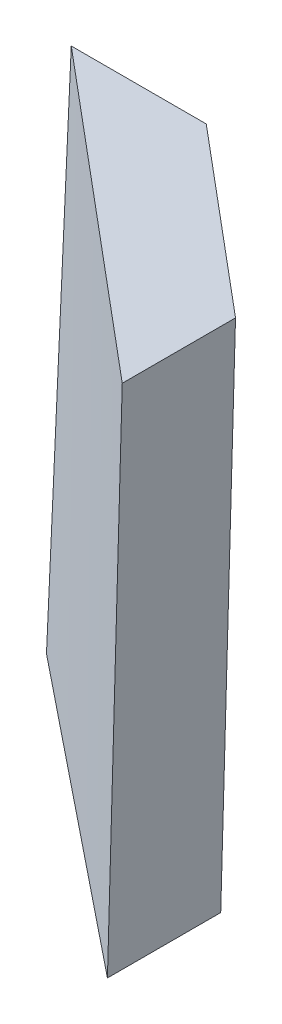
ISO-10303-21;
HEADER;
FILE_DESCRIPTION(('STEP AP214'),'2;1');
FILE_NAME('part.step','',(''),(''),'','','');
FILE_SCHEMA(('AUTOMOTIVE_DESIGN { 1 0 10303 214 1 1 1 1 }'));
ENDSEC;
DATA;
#1=APPLICATION_CONTEXT('core data for automotive mechanical design processes');
#2=APPLICATION_PROTOCOL_DEFINITION('international standard','automotive_design',2000,#1);
#3=PRODUCT_CONTEXT('',#1,'mechanical');
#4=PRODUCT('Part','Part','',(#3));
#5=PRODUCT_RELATED_PRODUCT_CATEGORY('part','',(#4));
#6=PRODUCT_DEFINITION_FORMATION('','',#4);
#7=PRODUCT_DEFINITION_CONTEXT('part definition',#1,'design');
#8=PRODUCT_DEFINITION('design','',#6,#7);
#9=PRODUCT_DEFINITION_SHAPE('','',#8);
#10=(LENGTH_UNIT() NAMED_UNIT(*) SI_UNIT(.MILLI.,.METRE.));
#11=(NAMED_UNIT(*) PLANE_ANGLE_UNIT() SI_UNIT($,.RADIAN.));
#12=(NAMED_UNIT(*) SI_UNIT($,.STERADIAN.) SOLID_ANGLE_UNIT());
#13=UNCERTAINTY_MEASURE_WITH_UNIT(LENGTH_MEASURE(1.E-05),#10,'distance_accuracy_value','');
#14=(GEOMETRIC_REPRESENTATION_CONTEXT(3) GLOBAL_UNCERTAINTY_ASSIGNED_CONTEXT((#13)) GLOBAL_UNIT_ASSIGNED_CONTEXT((#10,
#11,#12)) REPRESENTATION_CONTEXT('',''));
#15=CARTESIAN_POINT('',(0.,0.,0.));
#16=DIRECTION('',(0.,0.,1.));
#17=DIRECTION('',(1.,0.,0.));
#18=AXIS2_PLACEMENT_3D('',#15,#16,#17);
#19=CARTESIAN_POINT('',(0.,75.,0.));
#20=DIRECTION('',(0.,1.,0.));
#21=DIRECTION('',(0.,0.,1.));
#22=AXIS2_PLACEMENT_3D('',#19,#20,#21);
#23=PLANE('',#22);
#24=DIRECTION('',(0.765920955544199,0.,0.642934747745259));
#25=VECTOR('',#24,1.);
#26=CARTESIAN_POINT('',(46.7061178842105,75.,35.7889218303018));
#27=LINE('',#26,#25);
#28=CARTESIAN_POINT('',(0.95,75.,-2.62));
#29=VERTEX_POINT('',#28);
#30=CARTESIAN_POINT('',(46.7061178842105,75.,35.7889218303018));
#31=VERTEX_POINT('',#30);
#32=EDGE_CURVE('E109',#29,#31,#27,.T.);
#33=ORIENTED_EDGE('',*,*,#32,.T.);
#34=DIRECTION('',(0.,0.,-1.));
#35=VECTOR('',#34,1.);
#36=CARTESIAN_POINT('',(46.7061178842105,75.,19.4686998680778));
#37=LINE('',#36,#35);
#38=CARTESIAN_POINT('',(46.7061178842105,75.,19.4686998680778));
#39=VERTEX_POINT('',#38);
#40=EDGE_CURVE('E12',#31,#39,#37,.T.);
#41=ORIENTED_EDGE('',*,*,#40,.T.);
#42=DIRECTION('',(-0.76582584815751,0.,-0.643048031093969));
#43=VECTOR('',#42,1.);
#44=CARTESIAN_POINT('',(20.4,75.,-2.62));
#45=LINE('',#44,#43);
#46=CARTESIAN_POINT('',(20.4,75.,-2.62));
#47=VERTEX_POINT('',#46);
#48=EDGE_CURVE('E64',#39,#47,#45,.T.);
#49=ORIENTED_EDGE('',*,*,#48,.T.);
#50=DIRECTION('',(-1.,0.,0.));
#51=VECTOR('',#50,1.);
#52=CARTESIAN_POINT('',(0.95,75.,-2.62));
#53=LINE('',#52,#51);
#54=EDGE_CURVE('E197',#47,#29,#53,.T.);
#55=ORIENTED_EDGE('',*,*,#54,.T.);
#56=EDGE_LOOP('',(#33,#41,#49,#55));
#57=FACE_BOUND('',#56,.T.);
#58=ADVANCED_FACE('F53',(#57),#23,.T.);
#59=CARTESIAN_POINT('',(0.,0.,0.));
#60=DIRECTION('',(0.,1.,0.));
#61=DIRECTION('',(0.,0.,1.));
#62=AXIS2_PLACEMENT_3D('',#59,#60,#61);
#63=PLANE('',#62);
#64=DIRECTION('',(0.779278843955061,0.,0.626677335926602));
#65=VECTOR('',#64,1.);
#66=CARTESIAN_POINT('',(44.8552902580533,0.,36.0715474559352));
#67=LINE('',#66,#65);
#68=CARTESIAN_POINT('',(0.,0.,0.));
#69=VERTEX_POINT('',#68);
#70=CARTESIAN_POINT('',(44.8552902580533,0.,36.0715474559352));
#71=VERTEX_POINT('',#70);
#72=EDGE_CURVE('E166',#69,#71,#67,.T.);
#73=ORIENTED_EDGE('',*,*,#72,.F.);
#74=DIRECTION('',(-1.,0.,0.));
#75=VECTOR('',#74,1.);
#76=CARTESIAN_POINT('',(0.,0.,0.));
#77=LINE('',#76,#75);
#78=CARTESIAN_POINT('',(19.45,0.,0.));
#79=VERTEX_POINT('',#78);
#80=EDGE_CURVE('E124',#79,#69,#77,.T.);
#81=ORIENTED_EDGE('',*,*,#80,.F.);
#82=DIRECTION('',(-0.789474526353429,0.,-0.613783326784811));
#83=VECTOR('',#82,1.);
#84=CARTESIAN_POINT('',(19.45,0.,0.));
#85=LINE('',#84,#83);
#86=CARTESIAN_POINT('',(44.8552902580533,0.,19.7515474559352));
#87=VERTEX_POINT('',#86);
#88=EDGE_CURVE('E103',#87,#79,#85,.T.);
#89=ORIENTED_EDGE('',*,*,#88,.F.);
#90=DIRECTION('',(0.,0.,-1.));
#91=VECTOR('',#90,1.);
#92=CARTESIAN_POINT('',(44.8552902580533,0.,19.7515474559352));
#93=LINE('',#92,#91);
#94=EDGE_CURVE('E111',#71,#87,#93,.T.);
#95=ORIENTED_EDGE('',*,*,#94,.F.);
#96=EDGE_LOOP('',(#73,#81,#89,#95));
#97=FACE_BOUND('',#96,.T.);
#98=ADVANCED_FACE('F123',(#97),#63,.F.);
#99=CARTESIAN_POINT('',(0.,0.,0.));
#100=DIRECTION('',(0.,0.0349120375891681,0.999390389002902));
#101=DIRECTION('',(0.,-0.999390389002902,0.0349120375891681));
#102=AXIS2_PLACEMENT_3D('',#99,#100,#101);
#103=PLANE('',#102);
#104=DIRECTION('',(0.0126579307583425,0.999310323027041,-0.0349092406177446));
#105=VECTOR('',#104,1.);
#106=CARTESIAN_POINT('',(0.,0.,0.));
#107=LINE('',#106,#105);
#108=EDGE_CURVE('E118',#69,#29,#107,.T.);
#109=ORIENTED_EDGE('',*,*,#108,.T.);
#110=ORIENTED_EDGE('',*,*,#54,.F.);
#111=DIRECTION('',(0.0126579307583425,0.999310323027041,-0.0349092406177446));
#112=VECTOR('',#111,1.);
#113=CARTESIAN_POINT('',(19.45,0.,0.));
#114=LINE('',#113,#112);
#115=EDGE_CURVE('E209',#79,#47,#114,.T.);
#116=ORIENTED_EDGE('',*,*,#115,.F.);
#117=ORIENTED_EDGE('',*,*,#80,.T.);
#118=EDGE_LOOP('',(#109,#110,#116,#117));
#119=FACE_BOUND('',#118,.T.);
#120=ADVANCED_FACE('F144',(#119),#103,.F.);
#121=CARTESIAN_POINT('',(44.8552902580533,0.,19.7515474559352));
#122=CARTESIAN_POINT('',(46.7061178842105,75.,19.4686998680778));
#123=CARTESIAN_POINT('',(40.6210752150444,0.,16.4596228799459));
#124=CARTESIAN_POINT('',(42.3217649035087,75.,15.7872498900649));
#125=CARTESIAN_POINT('',(36.3868601720354,0.,13.1676983039567));
#126=CARTESIAN_POINT('',(37.937411922807,75.,12.1057999120519));
#127=CARTESIAN_POINT('',(27.9184300860177,0.,6.58384915197831));
#128=CARTESIAN_POINT('',(29.1687059614035,75.,4.74289995602595));
#129=CARTESIAN_POINT('',(23.6842150430088,0.,3.29192457598914));
#130=CARTESIAN_POINT('',(24.7843529807017,75.,1.06144997801298));
#131=CARTESIAN_POINT('',(19.45,0.,0.));
#132=CARTESIAN_POINT('',(20.4,75.,-2.62));
#133=B_SPLINE_SURFACE_WITH_KNOTS('',3,1,((#121,#122),(#123,#124),(#125,#126),(#127,#128),(#129,
#130),(#131,#132)),.UNSPECIFIED.,.F.,.F.,.F.,(4,2,4),(2,2),(0.,0.5,1.),(0.,1.),.UNSPECIFIED.);
#134=DIRECTION('',(0.0246700155585965,0.999688539735278,-0.00377012656097016));
#135=VECTOR('',#134,1.);
#136=CARTESIAN_POINT('',(44.8552902580533,0.,19.7515474559352));
#137=LINE('',#136,#135);
#138=EDGE_CURVE('E98',#87,#39,#137,.T.);
#139=ORIENTED_EDGE('',*,*,#88,.T.);
#140=ORIENTED_EDGE('',*,*,#115,.T.);
#141=ORIENTED_EDGE('',*,*,#48,.F.);
#142=ORIENTED_EDGE('',*,*,#138,.F.);
#143=EDGE_LOOP('',(#139,#140,#141,#142));
#144=FACE_BOUND('',#143,.T.);
#145=ADVANCED_FACE('F100',(#144),#133,.T.);
#146=CARTESIAN_POINT('',(0.,0.,0.));
#147=CARTESIAN_POINT('',(0.95,75.,-2.61999999999999));
#148=CARTESIAN_POINT('',(7.4758817096756,0.,6.01192457598923));
#149=CARTESIAN_POINT('',(8.57601964736841,75.,3.78148697171698));
#150=CARTESIAN_POINT('',(14.9517634193512,0.,12.0238491519785));
#151=CARTESIAN_POINT('',(16.2020392947368,75.,10.1829739434339));
#152=CARTESIAN_POINT('',(29.9035268387023,0.,24.0476983039569));
#153=CARTESIAN_POINT('',(31.4540785894736,75.,22.9859478868679));
#154=CARTESIAN_POINT('',(37.3794085483778,0.,30.059622879946));
#155=CARTESIAN_POINT('',(39.0800982368421,75.,29.3874348585848));
#156=CARTESIAN_POINT('',(44.8552902580533,0.,36.0715474559352));
#157=CARTESIAN_POINT('',(46.7061178842105,75.,35.7889218303018));
#158=B_SPLINE_SURFACE_WITH_KNOTS('',3,1,((#146,#147),(#148,#149),(#150,#151),(#152,#153),(#154,
#155),(#156,#157)),.UNSPECIFIED.,.F.,.F.,.F.,(4,2,4),(2,2),(0.,0.5,1.),(0.,1.),.UNSPECIFIED.);
#159=DIRECTION('',(0.0246700158336628,0.99968855088163,-0.00376716802841958));
#160=VECTOR('',#159,1.);
#161=CARTESIAN_POINT('',(45.7807040711319,37.5,35.9302346431185));
#162=LINE('',#161,#160);
#163=EDGE_CURVE('E72',#71,#31,#162,.T.);
#164=ORIENTED_EDGE('',*,*,#72,.T.);
#165=ORIENTED_EDGE('',*,*,#163,.T.);
#166=ORIENTED_EDGE('',*,*,#32,.F.);
#167=ORIENTED_EDGE('',*,*,#108,.F.);
#168=EDGE_LOOP('',(#164,#165,#166,#167));
#169=FACE_BOUND('',#168,.T.);
#170=ADVANCED_FACE('F217',(#169),#158,.T.);
#171=CARTESIAN_POINT('',(44.8279905067218,-1.10625177673267,0.));
#172=DIRECTION('',(-0.999695644524636,0.0246701908884687,0.));
#173=DIRECTION('',(-0.0246701908884687,-0.999695644524636,0.));
#174=AXIS2_PLACEMENT_3D('',#171,#172,#173);
#175=PLANE('',#174);
#176=ORIENTED_EDGE('',*,*,#138,.T.);
#177=ORIENTED_EDGE('',*,*,#40,.F.);
#178=ORIENTED_EDGE('',*,*,#163,.F.);
#179=ORIENTED_EDGE('',*,*,#94,.T.);
#180=EDGE_LOOP('',(#176,#177,#178,#179));
#181=FACE_BOUND('',#180,.T.);
#182=ADVANCED_FACE('F113',(#181),#175,.F.);
#183=CLOSED_SHELL('',(#58,#98,#120,#145,#170,#182));
#184=MANIFOLD_SOLID_BREP('B2',#183);
#185=ADVANCED_BREP_SHAPE_REPRESENTATION('',(#18,#184),#14);
#186=SHAPE_DEFINITION_REPRESENTATION(#9,#185);
ENDSEC;
END-ISO-10303-21;
